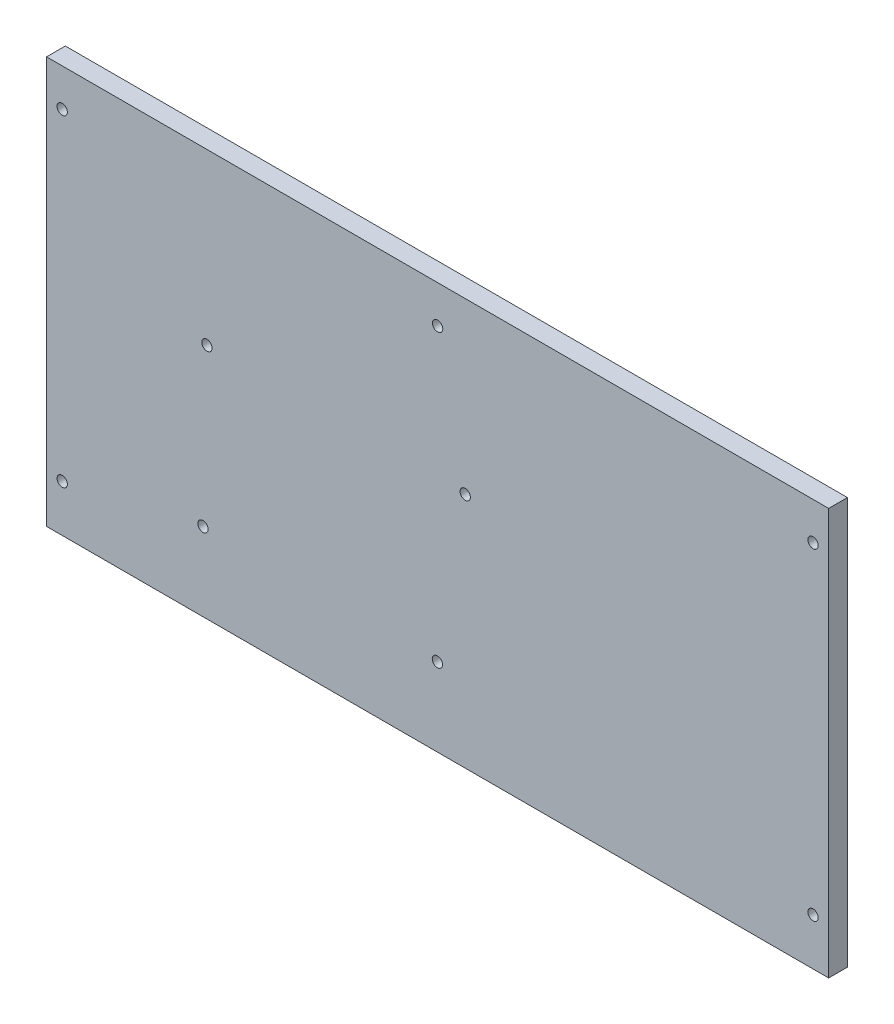
ISO-10303-21;
HEADER;
FILE_DESCRIPTION(('STEP AP214'),'2;1');
FILE_NAME('part.step','',(''),(''),'','','');
FILE_SCHEMA(('AUTOMOTIVE_DESIGN { 1 0 10303 214 1 1 1 1 }'));
ENDSEC;
DATA;
#1=APPLICATION_CONTEXT('core data for automotive mechanical design processes');
#2=APPLICATION_PROTOCOL_DEFINITION('international standard','automotive_design',2000,#1);
#3=PRODUCT_CONTEXT('',#1,'mechanical');
#4=PRODUCT('Part','Part','',(#3));
#5=PRODUCT_RELATED_PRODUCT_CATEGORY('part','',(#4));
#6=PRODUCT_DEFINITION_FORMATION('','',#4);
#7=PRODUCT_DEFINITION_CONTEXT('part definition',#1,'design');
#8=PRODUCT_DEFINITION('design','',#6,#7);
#9=PRODUCT_DEFINITION_SHAPE('','',#8);
#10=(LENGTH_UNIT() NAMED_UNIT(*) SI_UNIT(.MILLI.,.METRE.));
#11=(NAMED_UNIT(*) PLANE_ANGLE_UNIT() SI_UNIT($,.RADIAN.));
#12=(NAMED_UNIT(*) SI_UNIT($,.STERADIAN.) SOLID_ANGLE_UNIT());
#13=UNCERTAINTY_MEASURE_WITH_UNIT(LENGTH_MEASURE(1.E-05),#10,'distance_accuracy_value','');
#14=(GEOMETRIC_REPRESENTATION_CONTEXT(3) GLOBAL_UNCERTAINTY_ASSIGNED_CONTEXT((#13)) GLOBAL_UNIT_ASSIGNED_CONTEXT((#10,
#11,#12)) REPRESENTATION_CONTEXT('',''));
#15=CARTESIAN_POINT('',(0.,0.,0.));
#16=DIRECTION('',(0.,0.,1.));
#17=DIRECTION('',(1.,0.,0.));
#18=AXIS2_PLACEMENT_3D('',#15,#16,#17);
#19=CARTESIAN_POINT('',(0.,0.,6.));
#20=DIRECTION('',(0.,0.,1.));
#21=DIRECTION('',(1.,0.,0.));
#22=AXIS2_PLACEMENT_3D('',#19,#20,#21);
#23=PLANE('',#22);
#24=CARTESIAN_POINT('',(-75.,-40.,6.));
#25=DIRECTION('',(0.,0.,-1.));
#26=DIRECTION('',(-1.,0.,0.));
#27=AXIS2_PLACEMENT_3D('',#24,#25,#26);
#28=CIRCLE('',#27,1.65000000000003);
#29=CARTESIAN_POINT('',(-76.65,-40.,6.));
#30=VERTEX_POINT('',#29);
#31=EDGE_CURVE('E144',#30,#30,#28,.T.);
#32=ORIENTED_EDGE('',*,*,#31,.T.);
#33=EDGE_LOOP('',(#32));
#34=FACE_BOUND('',#33,.T.);
#35=CARTESIAN_POINT('',(-0.0699999999999451,-40.,6.));
#36=DIRECTION('',(0.,0.,-1.));
#37=DIRECTION('',(-1.,0.,0.));
#38=AXIS2_PLACEMENT_3D('',#35,#36,#37);
#39=CIRCLE('',#38,1.65000000000002);
#40=CARTESIAN_POINT('',(-1.71999999999996,-40.,6.));
#41=VERTEX_POINT('',#40);
#42=EDGE_CURVE('E156',#41,#41,#39,.T.);
#43=ORIENTED_EDGE('',*,*,#42,.T.);
#44=EDGE_LOOP('',(#43));
#45=FACE_BOUND('',#44,.T.);
#46=CARTESIAN_POINT('',(8.82000000000002,10.8,6.));
#47=DIRECTION('',(0.,0.,-1.));
#48=DIRECTION('',(-1.,0.,0.));
#49=AXIS2_PLACEMENT_3D('',#46,#47,#48);
#50=CIRCLE('',#49,1.65000000000007);
#51=CARTESIAN_POINT('',(7.16999999999995,10.8,6.));
#52=VERTEX_POINT('',#51);
#53=EDGE_CURVE('E150',#52,#52,#50,.T.);
#54=ORIENTED_EDGE('',*,*,#53,.T.);
#55=EDGE_LOOP('',(#54));
#56=FACE_BOUND('',#55,.T.);
#57=CARTESIAN_POINT('',(-73.73,10.8,6.));
#58=DIRECTION('',(0.,0.,-1.));
#59=DIRECTION('',(-1.,0.,0.));
#60=AXIS2_PLACEMENT_3D('',#57,#58,#59);
#61=CIRCLE('',#60,1.65000000000002);
#62=CARTESIAN_POINT('',(-75.38,10.8,6.));
#63=VERTEX_POINT('',#62);
#64=EDGE_CURVE('E138',#63,#63,#61,.T.);
#65=ORIENTED_EDGE('',*,*,#64,.T.);
#66=EDGE_LOOP('',(#65));
#67=FACE_BOUND('',#66,.T.);
#68=CARTESIAN_POINT('',(120.,-50.,6.));
#69=DIRECTION('',(0.,0.,1.));
#70=DIRECTION('',(-1.,0.,0.));
#71=AXIS2_PLACEMENT_3D('',#68,#69,#70);
#72=CIRCLE('',#71,1.65);
#73=CARTESIAN_POINT('',(118.35,-50.,6.));
#74=VERTEX_POINT('',#73);
#75=EDGE_CURVE('E126',#74,#74,#72,.T.);
#76=ORIENTED_EDGE('',*,*,#75,.F.);
#77=EDGE_LOOP('',(#76));
#78=FACE_BOUND('',#77,.T.);
#79=CARTESIAN_POINT('',(-120.,-50.,6.));
#80=DIRECTION('',(0.,0.,1.));
#81=DIRECTION('',(1.,0.,0.));
#82=AXIS2_PLACEMENT_3D('',#79,#80,#81);
#83=CIRCLE('',#82,1.65);
#84=CARTESIAN_POINT('',(-118.35,-50.,6.));
#85=VERTEX_POINT('',#84);
#86=EDGE_CURVE('E114',#85,#85,#83,.T.);
#87=ORIENTED_EDGE('',*,*,#86,.F.);
#88=EDGE_LOOP('',(#87));
#89=FACE_BOUND('',#88,.T.);
#90=DIRECTION('',(0.,1.,0.));
#91=VECTOR('',#90,1.);
#92=CARTESIAN_POINT('',(125.,65.,6.));
#93=LINE('',#92,#91);
#94=CARTESIAN_POINT('',(125.,-65.,6.));
#95=VERTEX_POINT('',#94);
#96=CARTESIAN_POINT('',(125.,65.,6.));
#97=VERTEX_POINT('',#96);
#98=EDGE_CURVE('E84',#95,#97,#93,.T.);
#99=ORIENTED_EDGE('',*,*,#98,.T.);
#100=DIRECTION('',(-1.,0.,0.));
#101=VECTOR('',#100,1.);
#102=CARTESIAN_POINT('',(-125.,65.,6.));
#103=LINE('',#102,#101);
#104=CARTESIAN_POINT('',(-125.,65.,6.));
#105=VERTEX_POINT('',#104);
#106=EDGE_CURVE('E79',#97,#105,#103,.T.);
#107=ORIENTED_EDGE('',*,*,#106,.T.);
#108=DIRECTION('',(0.,-1.,0.));
#109=VECTOR('',#108,1.);
#110=CARTESIAN_POINT('',(-125.,65.,6.));
#111=LINE('',#110,#109);
#112=CARTESIAN_POINT('',(-125.,-65.,6.));
#113=VERTEX_POINT('',#112);
#114=EDGE_CURVE('E82',#105,#113,#111,.T.);
#115=ORIENTED_EDGE('',*,*,#114,.T.);
#116=DIRECTION('',(1.,0.,0.));
#117=VECTOR('',#116,1.);
#118=CARTESIAN_POINT('',(-125.,-65.,6.));
#119=LINE('',#118,#117);
#120=EDGE_CURVE('E49',#113,#95,#119,.T.);
#121=ORIENTED_EDGE('',*,*,#120,.T.);
#122=EDGE_LOOP('',(#99,#107,#115,#121));
#123=FACE_BOUND('',#122,.T.);
#124=CARTESIAN_POINT('',(-120.,53.,6.));
#125=DIRECTION('',(0.,0.,1.));
#126=DIRECTION('',(1.,0.,0.));
#127=AXIS2_PLACEMENT_3D('',#124,#125,#126);
#128=CIRCLE('',#127,1.65);
#129=CARTESIAN_POINT('',(-118.35,53.,6.));
#130=VERTEX_POINT('',#129);
#131=EDGE_CURVE('E99',#130,#130,#128,.T.);
#132=ORIENTED_EDGE('',*,*,#131,.F.);
#133=EDGE_LOOP('',(#132));
#134=FACE_BOUND('',#133,.T.);
#135=CARTESIAN_POINT('',(0.,53.,6.));
#136=DIRECTION('',(0.,0.,1.));
#137=DIRECTION('',(1.,0.,0.));
#138=AXIS2_PLACEMENT_3D('',#135,#136,#137);
#139=CIRCLE('',#138,1.65);
#140=CARTESIAN_POINT('',(1.65000000000004,53.,6.));
#141=VERTEX_POINT('',#140);
#142=EDGE_CURVE('E120',#141,#141,#139,.T.);
#143=ORIENTED_EDGE('',*,*,#142,.F.);
#144=EDGE_LOOP('',(#143));
#145=FACE_BOUND('',#144,.T.);
#146=CARTESIAN_POINT('',(120.,53.,6.));
#147=DIRECTION('',(0.,0.,1.));
#148=DIRECTION('',(-1.,0.,0.));
#149=AXIS2_PLACEMENT_3D('',#146,#147,#148);
#150=CIRCLE('',#149,1.65);
#151=CARTESIAN_POINT('',(118.35,53.,6.));
#152=VERTEX_POINT('',#151);
#153=EDGE_CURVE('E132',#152,#152,#150,.T.);
#154=ORIENTED_EDGE('',*,*,#153,.F.);
#155=EDGE_LOOP('',(#154));
#156=FACE_BOUND('',#155,.T.);
#157=ADVANCED_FACE('F32',(#34,#45,#56,#67,#78,#89,#123,#134,#145,#156),#23,.T.);
#158=CARTESIAN_POINT('',(0.,0.,0.));
#159=DIRECTION('',(0.,0.,1.));
#160=DIRECTION('',(1.,0.,0.));
#161=AXIS2_PLACEMENT_3D('',#158,#159,#160);
#162=PLANE('',#161);
#163=CARTESIAN_POINT('',(-75.,-40.,0.));
#164=DIRECTION('',(0.,0.,-1.));
#165=DIRECTION('',(-1.,0.,0.));
#166=AXIS2_PLACEMENT_3D('',#163,#164,#165);
#167=CIRCLE('',#166,1.65000000000003);
#168=CARTESIAN_POINT('',(-76.65,-40.,0.));
#169=VERTEX_POINT('',#168);
#170=EDGE_CURVE('E159',#169,#169,#167,.T.);
#171=ORIENTED_EDGE('',*,*,#170,.F.);
#172=EDGE_LOOP('',(#171));
#173=FACE_BOUND('',#172,.T.);
#174=CARTESIAN_POINT('',(-0.0699999999999451,-40.,0.));
#175=DIRECTION('',(0.,0.,-1.));
#176=DIRECTION('',(-1.,0.,0.));
#177=AXIS2_PLACEMENT_3D('',#174,#175,#176);
#178=CIRCLE('',#177,1.65000000000002);
#179=CARTESIAN_POINT('',(-1.71999999999996,-40.,0.));
#180=VERTEX_POINT('',#179);
#181=EDGE_CURVE('E153',#180,#180,#178,.T.);
#182=ORIENTED_EDGE('',*,*,#181,.F.);
#183=EDGE_LOOP('',(#182));
#184=FACE_BOUND('',#183,.T.);
#185=CARTESIAN_POINT('',(8.82000000000002,10.8,0.));
#186=DIRECTION('',(0.,0.,-1.));
#187=DIRECTION('',(-1.,0.,0.));
#188=AXIS2_PLACEMENT_3D('',#185,#186,#187);
#189=CIRCLE('',#188,1.65000000000007);
#190=CARTESIAN_POINT('',(7.16999999999995,10.8,0.));
#191=VERTEX_POINT('',#190);
#192=EDGE_CURVE('E147',#191,#191,#189,.T.);
#193=ORIENTED_EDGE('',*,*,#192,.F.);
#194=EDGE_LOOP('',(#193));
#195=FACE_BOUND('',#194,.T.);
#196=CARTESIAN_POINT('',(-73.73,10.8,0.));
#197=DIRECTION('',(0.,0.,-1.));
#198=DIRECTION('',(-1.,0.,0.));
#199=AXIS2_PLACEMENT_3D('',#196,#197,#198);
#200=CIRCLE('',#199,1.65000000000002);
#201=CARTESIAN_POINT('',(-75.38,10.8,0.));
#202=VERTEX_POINT('',#201);
#203=EDGE_CURVE('E141',#202,#202,#200,.T.);
#204=ORIENTED_EDGE('',*,*,#203,.F.);
#205=EDGE_LOOP('',(#204));
#206=FACE_BOUND('',#205,.T.);
#207=DIRECTION('',(0.,1.,0.));
#208=VECTOR('',#207,1.);
#209=CARTESIAN_POINT('',(125.,65.,0.));
#210=LINE('',#209,#208);
#211=CARTESIAN_POINT('',(125.,-65.,0.));
#212=VERTEX_POINT('',#211);
#213=CARTESIAN_POINT('',(125.,65.,0.));
#214=VERTEX_POINT('',#213);
#215=EDGE_CURVE('E96',#212,#214,#210,.T.);
#216=ORIENTED_EDGE('',*,*,#215,.F.);
#217=DIRECTION('',(1.,0.,0.));
#218=VECTOR('',#217,1.);
#219=CARTESIAN_POINT('',(-125.,-65.,0.));
#220=LINE('',#219,#218);
#221=CARTESIAN_POINT('',(-125.,-65.,0.));
#222=VERTEX_POINT('',#221);
#223=EDGE_CURVE('E72',#222,#212,#220,.T.);
#224=ORIENTED_EDGE('',*,*,#223,.F.);
#225=DIRECTION('',(0.,-1.,0.));
#226=VECTOR('',#225,1.);
#227=CARTESIAN_POINT('',(-125.,65.,0.));
#228=LINE('',#227,#226);
#229=CARTESIAN_POINT('',(-125.,65.,0.));
#230=VERTEX_POINT('',#229);
#231=EDGE_CURVE('E66',#230,#222,#228,.T.);
#232=ORIENTED_EDGE('',*,*,#231,.F.);
#233=DIRECTION('',(-1.,0.,0.));
#234=VECTOR('',#233,1.);
#235=CARTESIAN_POINT('',(-125.,65.,0.));
#236=LINE('',#235,#234);
#237=EDGE_CURVE('E88',#214,#230,#236,.T.);
#238=ORIENTED_EDGE('',*,*,#237,.F.);
#239=EDGE_LOOP('',(#216,#224,#232,#238));
#240=FACE_BOUND('',#239,.T.);
#241=CARTESIAN_POINT('',(-120.,53.,0.));
#242=DIRECTION('',(0.,0.,1.));
#243=DIRECTION('',(1.,0.,0.));
#244=AXIS2_PLACEMENT_3D('',#241,#242,#243);
#245=CIRCLE('',#244,1.65);
#246=CARTESIAN_POINT('',(-118.35,53.,0.));
#247=VERTEX_POINT('',#246);
#248=EDGE_CURVE('E111',#247,#247,#245,.T.);
#249=ORIENTED_EDGE('',*,*,#248,.T.);
#250=EDGE_LOOP('',(#249));
#251=FACE_BOUND('',#250,.T.);
#252=CARTESIAN_POINT('',(-120.,-50.,0.));
#253=DIRECTION('',(0.,0.,1.));
#254=DIRECTION('',(1.,0.,0.));
#255=AXIS2_PLACEMENT_3D('',#252,#253,#254);
#256=CIRCLE('',#255,1.65);
#257=CARTESIAN_POINT('',(-118.35,-50.,0.));
#258=VERTEX_POINT('',#257);
#259=EDGE_CURVE('E117',#258,#258,#256,.T.);
#260=ORIENTED_EDGE('',*,*,#259,.T.);
#261=EDGE_LOOP('',(#260));
#262=FACE_BOUND('',#261,.T.);
#263=CARTESIAN_POINT('',(0.,53.,0.));
#264=DIRECTION('',(0.,0.,1.));
#265=DIRECTION('',(1.,0.,0.));
#266=AXIS2_PLACEMENT_3D('',#263,#264,#265);
#267=CIRCLE('',#266,1.65);
#268=CARTESIAN_POINT('',(1.65000000000004,53.,0.));
#269=VERTEX_POINT('',#268);
#270=EDGE_CURVE('E123',#269,#269,#267,.T.);
#271=ORIENTED_EDGE('',*,*,#270,.T.);
#272=EDGE_LOOP('',(#271));
#273=FACE_BOUND('',#272,.T.);
#274=CARTESIAN_POINT('',(120.,-50.,0.));
#275=DIRECTION('',(0.,0.,1.));
#276=DIRECTION('',(-1.,0.,0.));
#277=AXIS2_PLACEMENT_3D('',#274,#275,#276);
#278=CIRCLE('',#277,1.65);
#279=CARTESIAN_POINT('',(118.35,-50.,0.));
#280=VERTEX_POINT('',#279);
#281=EDGE_CURVE('E129',#280,#280,#278,.T.);
#282=ORIENTED_EDGE('',*,*,#281,.T.);
#283=EDGE_LOOP('',(#282));
#284=FACE_BOUND('',#283,.T.);
#285=CARTESIAN_POINT('',(120.,53.,0.));
#286=DIRECTION('',(0.,0.,1.));
#287=DIRECTION('',(-1.,0.,0.));
#288=AXIS2_PLACEMENT_3D('',#285,#286,#287);
#289=CIRCLE('',#288,1.65);
#290=CARTESIAN_POINT('',(118.35,53.,0.));
#291=VERTEX_POINT('',#290);
#292=EDGE_CURVE('E135',#291,#291,#289,.T.);
#293=ORIENTED_EDGE('',*,*,#292,.T.);
#294=EDGE_LOOP('',(#293));
#295=FACE_BOUND('',#294,.T.);
#296=ADVANCED_FACE('F107',(#173,#184,#195,#206,#240,#251,#262,#273,#284,#295),#162,.F.);
#297=CARTESIAN_POINT('',(125.,65.,6.));
#298=DIRECTION('',(-1.,0.,0.));
#299=DIRECTION('',(0.,-1.,0.));
#300=AXIS2_PLACEMENT_3D('',#297,#298,#299);
#301=PLANE('',#300);
#302=ORIENTED_EDGE('',*,*,#215,.T.);
#303=DIRECTION('',(0.,0.,-1.));
#304=VECTOR('',#303,1.);
#305=CARTESIAN_POINT('',(125.,65.,6.));
#306=LINE('',#305,#304);
#307=EDGE_CURVE('E11',#97,#214,#306,.T.);
#308=ORIENTED_EDGE('',*,*,#307,.F.);
#309=ORIENTED_EDGE('',*,*,#98,.F.);
#310=DIRECTION('',(0.,0.,-1.));
#311=VECTOR('',#310,1.);
#312=CARTESIAN_POINT('',(125.,-65.,6.));
#313=LINE('',#312,#311);
#314=EDGE_CURVE('E92',#95,#212,#313,.T.);
#315=ORIENTED_EDGE('',*,*,#314,.T.);
#316=EDGE_LOOP('',(#302,#308,#309,#315));
#317=FACE_BOUND('',#316,.T.);
#318=ADVANCED_FACE('F34',(#317),#301,.F.);
#319=CARTESIAN_POINT('',(-125.,65.,6.));
#320=DIRECTION('',(0.,-1.,0.));
#321=DIRECTION('',(0.,0.,-1.));
#322=AXIS2_PLACEMENT_3D('',#319,#320,#321);
#323=PLANE('',#322);
#324=ORIENTED_EDGE('',*,*,#237,.T.);
#325=DIRECTION('',(0.,0.,-1.));
#326=VECTOR('',#325,1.);
#327=CARTESIAN_POINT('',(-125.,65.,6.));
#328=LINE('',#327,#326);
#329=EDGE_CURVE('E41',#105,#230,#328,.T.);
#330=ORIENTED_EDGE('',*,*,#329,.F.);
#331=ORIENTED_EDGE('',*,*,#106,.F.);
#332=ORIENTED_EDGE('',*,*,#307,.T.);
#333=EDGE_LOOP('',(#324,#330,#331,#332));
#334=FACE_BOUND('',#333,.T.);
#335=ADVANCED_FACE('F87',(#334),#323,.F.);
#336=CARTESIAN_POINT('',(-125.,65.,6.));
#337=DIRECTION('',(1.,0.,0.));
#338=DIRECTION('',(0.,1.,0.));
#339=AXIS2_PLACEMENT_3D('',#336,#337,#338);
#340=PLANE('',#339);
#341=ORIENTED_EDGE('',*,*,#231,.T.);
#342=DIRECTION('',(0.,0.,-1.));
#343=VECTOR('',#342,1.);
#344=CARTESIAN_POINT('',(-125.,-65.,6.));
#345=LINE('',#344,#343);
#346=EDGE_CURVE('E89',#113,#222,#345,.T.);
#347=ORIENTED_EDGE('',*,*,#346,.F.);
#348=ORIENTED_EDGE('',*,*,#114,.F.);
#349=ORIENTED_EDGE('',*,*,#329,.T.);
#350=EDGE_LOOP('',(#341,#347,#348,#349));
#351=FACE_BOUND('',#350,.T.);
#352=ADVANCED_FACE('F90',(#351),#340,.F.);
#353=CARTESIAN_POINT('',(-125.,-65.,6.));
#354=DIRECTION('',(0.,1.,0.));
#355=DIRECTION('',(0.,0.,1.));
#356=AXIS2_PLACEMENT_3D('',#353,#354,#355);
#357=PLANE('',#356);
#358=ORIENTED_EDGE('',*,*,#223,.T.);
#359=ORIENTED_EDGE('',*,*,#314,.F.);
#360=ORIENTED_EDGE('',*,*,#120,.F.);
#361=ORIENTED_EDGE('',*,*,#346,.T.);
#362=EDGE_LOOP('',(#358,#359,#360,#361));
#363=FACE_BOUND('',#362,.T.);
#364=ADVANCED_FACE('F104',(#363),#357,.F.);
#365=CARTESIAN_POINT('',(-120.,53.,6.));
#366=DIRECTION('',(0.,0.,-1.));
#367=DIRECTION('',(-1.,0.,0.));
#368=AXIS2_PLACEMENT_3D('',#365,#366,#367);
#369=CYLINDRICAL_SURFACE('',#368,1.65);
#370=ORIENTED_EDGE('',*,*,#131,.T.);
#371=EDGE_LOOP('',(#370));
#372=FACE_BOUND('',#371,.T.);
#373=ORIENTED_EDGE('',*,*,#248,.F.);
#374=EDGE_LOOP('',(#373));
#375=FACE_BOUND('',#374,.T.);
#376=ADVANCED_FACE('F204',(#372,#375),#369,.F.);
#377=CARTESIAN_POINT('',(-120.,-50.,6.));
#378=DIRECTION('',(0.,0.,-1.));
#379=DIRECTION('',(-1.,0.,0.));
#380=AXIS2_PLACEMENT_3D('',#377,#378,#379);
#381=CYLINDRICAL_SURFACE('',#380,1.65);
#382=ORIENTED_EDGE('',*,*,#86,.T.);
#383=EDGE_LOOP('',(#382));
#384=FACE_BOUND('',#383,.T.);
#385=ORIENTED_EDGE('',*,*,#259,.F.);
#386=EDGE_LOOP('',(#385));
#387=FACE_BOUND('',#386,.T.);
#388=ADVANCED_FACE('F263',(#384,#387),#381,.F.);
#389=CARTESIAN_POINT('',(0.,53.,6.));
#390=DIRECTION('',(0.,0.,-1.));
#391=DIRECTION('',(-1.,0.,0.));
#392=AXIS2_PLACEMENT_3D('',#389,#390,#391);
#393=CYLINDRICAL_SURFACE('',#392,1.65);
#394=ORIENTED_EDGE('',*,*,#142,.T.);
#395=EDGE_LOOP('',(#394));
#396=FACE_BOUND('',#395,.T.);
#397=ORIENTED_EDGE('',*,*,#270,.F.);
#398=EDGE_LOOP('',(#397));
#399=FACE_BOUND('',#398,.T.);
#400=ADVANCED_FACE('F266',(#396,#399),#393,.F.);
#401=CARTESIAN_POINT('',(120.,-50.,6.));
#402=DIRECTION('',(0.,0.,-1.));
#403=DIRECTION('',(-1.,0.,0.));
#404=AXIS2_PLACEMENT_3D('',#401,#402,#403);
#405=CYLINDRICAL_SURFACE('',#404,1.65);
#406=ORIENTED_EDGE('',*,*,#75,.T.);
#407=EDGE_LOOP('',(#406));
#408=FACE_BOUND('',#407,.T.);
#409=ORIENTED_EDGE('',*,*,#281,.F.);
#410=EDGE_LOOP('',(#409));
#411=FACE_BOUND('',#410,.T.);
#412=ADVANCED_FACE('F195',(#408,#411),#405,.F.);
#413=CARTESIAN_POINT('',(120.,53.,6.));
#414=DIRECTION('',(0.,0.,-1.));
#415=DIRECTION('',(-1.,0.,0.));
#416=AXIS2_PLACEMENT_3D('',#413,#414,#415);
#417=CYLINDRICAL_SURFACE('',#416,1.65);
#418=ORIENTED_EDGE('',*,*,#153,.T.);
#419=EDGE_LOOP('',(#418));
#420=FACE_BOUND('',#419,.T.);
#421=ORIENTED_EDGE('',*,*,#292,.F.);
#422=EDGE_LOOP('',(#421));
#423=FACE_BOUND('',#422,.T.);
#424=ADVANCED_FACE('F186',(#420,#423),#417,.F.);
#425=CARTESIAN_POINT('',(-73.73,10.8,6.));
#426=DIRECTION('',(0.,0.,-1.));
#427=DIRECTION('',(-1.,0.,0.));
#428=AXIS2_PLACEMENT_3D('',#425,#426,#427);
#429=CYLINDRICAL_SURFACE('',#428,1.65000000000002);
#430=ORIENTED_EDGE('',*,*,#64,.F.);
#431=EDGE_LOOP('',(#430));
#432=FACE_BOUND('',#431,.T.);
#433=ORIENTED_EDGE('',*,*,#203,.T.);
#434=EDGE_LOOP('',(#433));
#435=FACE_BOUND('',#434,.T.);
#436=ADVANCED_FACE('F183',(#432,#435),#429,.F.);
#437=CARTESIAN_POINT('',(8.82000000000002,10.8,6.));
#438=DIRECTION('',(0.,0.,-1.));
#439=DIRECTION('',(-1.,0.,0.));
#440=AXIS2_PLACEMENT_3D('',#437,#438,#439);
#441=CYLINDRICAL_SURFACE('',#440,1.65000000000007);
#442=ORIENTED_EDGE('',*,*,#53,.F.);
#443=EDGE_LOOP('',(#442));
#444=FACE_BOUND('',#443,.T.);
#445=ORIENTED_EDGE('',*,*,#192,.T.);
#446=EDGE_LOOP('',(#445));
#447=FACE_BOUND('',#446,.T.);
#448=ADVANCED_FACE('F185',(#444,#447),#441,.F.);
#449=CARTESIAN_POINT('',(-0.0699999999999451,-40.,6.));
#450=DIRECTION('',(0.,0.,-1.));
#451=DIRECTION('',(-1.,0.,0.));
#452=AXIS2_PLACEMENT_3D('',#449,#450,#451);
#453=CYLINDRICAL_SURFACE('',#452,1.65000000000002);
#454=ORIENTED_EDGE('',*,*,#42,.F.);
#455=EDGE_LOOP('',(#454));
#456=FACE_BOUND('',#455,.T.);
#457=ORIENTED_EDGE('',*,*,#181,.T.);
#458=EDGE_LOOP('',(#457));
#459=FACE_BOUND('',#458,.T.);
#460=ADVANCED_FACE('F170',(#456,#459),#453,.F.);
#461=CARTESIAN_POINT('',(-75.,-40.,6.));
#462=DIRECTION('',(0.,0.,-1.));
#463=DIRECTION('',(-1.,0.,0.));
#464=AXIS2_PLACEMENT_3D('',#461,#462,#463);
#465=CYLINDRICAL_SURFACE('',#464,1.65000000000003);
#466=ORIENTED_EDGE('',*,*,#31,.F.);
#467=EDGE_LOOP('',(#466));
#468=FACE_BOUND('',#467,.T.);
#469=ORIENTED_EDGE('',*,*,#170,.T.);
#470=EDGE_LOOP('',(#469));
#471=FACE_BOUND('',#470,.T.);
#472=ADVANCED_FACE('F167',(#468,#471),#465,.F.);
#473=CLOSED_SHELL('',(#157,#296,#318,#335,#352,#364,#376,#388,#400,#412,#424,#436,#448,#460,#472));
#474=MANIFOLD_SOLID_BREP('B2',#473);
#475=ADVANCED_BREP_SHAPE_REPRESENTATION('',(#18,#474),#14);
#476=SHAPE_DEFINITION_REPRESENTATION(#9,#475);
ENDSEC;
END-ISO-10303-21;
